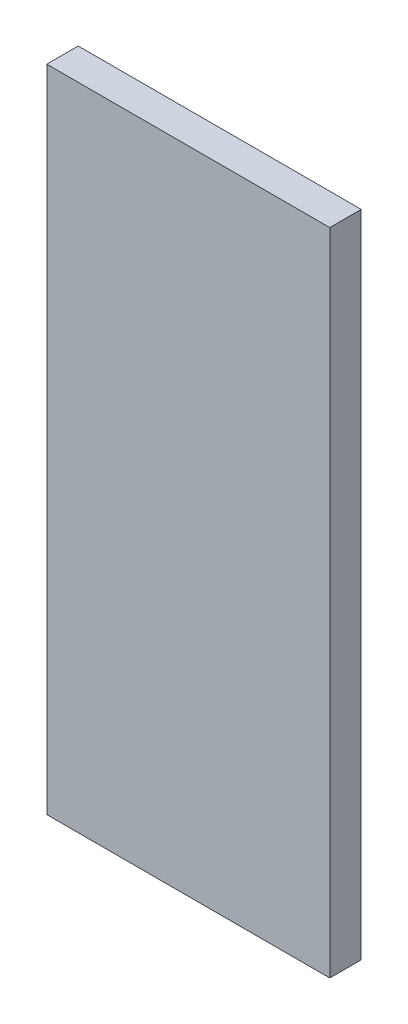
ISO-10303-21;
HEADER;
FILE_DESCRIPTION(('STEP AP214'),'2;1');
FILE_NAME('part.step','',(''),(''),'','','');
FILE_SCHEMA(('AUTOMOTIVE_DESIGN { 1 0 10303 214 1 1 1 1 }'));
ENDSEC;
DATA;
#1=APPLICATION_CONTEXT('core data for automotive mechanical design processes');
#2=APPLICATION_PROTOCOL_DEFINITION('international standard','automotive_design',2000,#1);
#3=PRODUCT_CONTEXT('',#1,'mechanical');
#4=PRODUCT('Part','Part','',(#3));
#5=PRODUCT_RELATED_PRODUCT_CATEGORY('part','',(#4));
#6=PRODUCT_DEFINITION_FORMATION('','',#4);
#7=PRODUCT_DEFINITION_CONTEXT('part definition',#1,'design');
#8=PRODUCT_DEFINITION('design','',#6,#7);
#9=PRODUCT_DEFINITION_SHAPE('','',#8);
#10=(LENGTH_UNIT() NAMED_UNIT(*) SI_UNIT(.MILLI.,.METRE.));
#11=(NAMED_UNIT(*) PLANE_ANGLE_UNIT() SI_UNIT($,.RADIAN.));
#12=(NAMED_UNIT(*) SI_UNIT($,.STERADIAN.) SOLID_ANGLE_UNIT());
#13=UNCERTAINTY_MEASURE_WITH_UNIT(LENGTH_MEASURE(1.E-05),#10,'distance_accuracy_value','');
#14=(GEOMETRIC_REPRESENTATION_CONTEXT(3) GLOBAL_UNCERTAINTY_ASSIGNED_CONTEXT((#13)) GLOBAL_UNIT_ASSIGNED_CONTEXT((#10,
#11,#12)) REPRESENTATION_CONTEXT('',''));
#15=CARTESIAN_POINT('',(0.,0.,0.));
#16=DIRECTION('',(0.,0.,1.));
#17=DIRECTION('',(1.,0.,0.));
#18=AXIS2_PLACEMENT_3D('',#15,#16,#17);
#19=CARTESIAN_POINT('',(13.5,31.,3.));
#20=DIRECTION('',(-1.,0.,0.));
#21=DIRECTION('',(0.,-1.,0.));
#22=AXIS2_PLACEMENT_3D('',#19,#20,#21);
#23=PLANE('',#22);
#24=DIRECTION('',(0.,1.,0.));
#25=VECTOR('',#24,1.);
#26=CARTESIAN_POINT('',(13.5,31.,0.));
#27=LINE('',#26,#25);
#28=CARTESIAN_POINT('',(13.5,-31.,0.));
#29=VERTEX_POINT('',#28);
#30=CARTESIAN_POINT('',(13.5,31.,0.));
#31=VERTEX_POINT('',#30);
#32=EDGE_CURVE('E96',#29,#31,#27,.T.);
#33=ORIENTED_EDGE('',*,*,#32,.T.);
#34=DIRECTION('',(0.,0.,-1.));
#35=VECTOR('',#34,1.);
#36=CARTESIAN_POINT('',(13.5,31.,3.));
#37=LINE('',#36,#35);
#38=CARTESIAN_POINT('',(13.5,31.,3.));
#39=VERTEX_POINT('',#38);
#40=EDGE_CURVE('E11',#39,#31,#37,.T.);
#41=ORIENTED_EDGE('',*,*,#40,.F.);
#42=DIRECTION('',(0.,1.,0.));
#43=VECTOR('',#42,1.);
#44=CARTESIAN_POINT('',(13.5,31.,3.));
#45=LINE('',#44,#43);
#46=CARTESIAN_POINT('',(13.5,-31.,3.));
#47=VERTEX_POINT('',#46);
#48=EDGE_CURVE('E84',#47,#39,#45,.T.);
#49=ORIENTED_EDGE('',*,*,#48,.F.);
#50=DIRECTION('',(0.,0.,-1.));
#51=VECTOR('',#50,1.);
#52=CARTESIAN_POINT('',(13.5,-31.,3.));
#53=LINE('',#52,#51);
#54=EDGE_CURVE('E92',#47,#29,#53,.T.);
#55=ORIENTED_EDGE('',*,*,#54,.T.);
#56=EDGE_LOOP('',(#33,#41,#49,#55));
#57=FACE_BOUND('',#56,.T.);
#58=ADVANCED_FACE('F33',(#57),#23,.F.);
#59=CARTESIAN_POINT('',(-13.5,31.,3.));
#60=DIRECTION('',(0.,-1.,0.));
#61=DIRECTION('',(0.,0.,-1.));
#62=AXIS2_PLACEMENT_3D('',#59,#60,#61);
#63=PLANE('',#62);
#64=DIRECTION('',(-1.,0.,0.));
#65=VECTOR('',#64,1.);
#66=CARTESIAN_POINT('',(-13.5,31.,0.));
#67=LINE('',#66,#65);
#68=CARTESIAN_POINT('',(-13.5,31.,0.));
#69=VERTEX_POINT('',#68);
#70=EDGE_CURVE('E88',#31,#69,#67,.T.);
#71=ORIENTED_EDGE('',*,*,#70,.T.);
#72=DIRECTION('',(0.,0.,-1.));
#73=VECTOR('',#72,1.);
#74=CARTESIAN_POINT('',(-13.5,31.,3.));
#75=LINE('',#74,#73);
#76=CARTESIAN_POINT('',(-13.5,31.,3.));
#77=VERTEX_POINT('',#76);
#78=EDGE_CURVE('E41',#77,#69,#75,.T.);
#79=ORIENTED_EDGE('',*,*,#78,.F.);
#80=DIRECTION('',(-1.,0.,0.));
#81=VECTOR('',#80,1.);
#82=CARTESIAN_POINT('',(-13.5,31.,3.));
#83=LINE('',#82,#81);
#84=EDGE_CURVE('E79',#39,#77,#83,.T.);
#85=ORIENTED_EDGE('',*,*,#84,.F.);
#86=ORIENTED_EDGE('',*,*,#40,.T.);
#87=EDGE_LOOP('',(#71,#79,#85,#86));
#88=FACE_BOUND('',#87,.T.);
#89=ADVANCED_FACE('F87',(#88),#63,.F.);
#90=CARTESIAN_POINT('',(-13.5,31.,3.));
#91=DIRECTION('',(1.,0.,0.));
#92=DIRECTION('',(0.,1.,0.));
#93=AXIS2_PLACEMENT_3D('',#90,#91,#92);
#94=PLANE('',#93);
#95=DIRECTION('',(0.,-1.,0.));
#96=VECTOR('',#95,1.);
#97=CARTESIAN_POINT('',(-13.5,31.,0.));
#98=LINE('',#97,#96);
#99=CARTESIAN_POINT('',(-13.5,-31.,0.));
#100=VERTEX_POINT('',#99);
#101=EDGE_CURVE('E66',#69,#100,#98,.T.);
#102=ORIENTED_EDGE('',*,*,#101,.T.);
#103=DIRECTION('',(0.,0.,-1.));
#104=VECTOR('',#103,1.);
#105=CARTESIAN_POINT('',(-13.5,-31.,3.));
#106=LINE('',#105,#104);
#107=CARTESIAN_POINT('',(-13.5,-31.,3.));
#108=VERTEX_POINT('',#107);
#109=EDGE_CURVE('E89',#108,#100,#106,.T.);
#110=ORIENTED_EDGE('',*,*,#109,.F.);
#111=DIRECTION('',(0.,-1.,0.));
#112=VECTOR('',#111,1.);
#113=CARTESIAN_POINT('',(-13.5,31.,3.));
#114=LINE('',#113,#112);
#115=EDGE_CURVE('E82',#77,#108,#114,.T.);
#116=ORIENTED_EDGE('',*,*,#115,.F.);
#117=ORIENTED_EDGE('',*,*,#78,.T.);
#118=EDGE_LOOP('',(#102,#110,#116,#117));
#119=FACE_BOUND('',#118,.T.);
#120=ADVANCED_FACE('F90',(#119),#94,.F.);
#121=CARTESIAN_POINT('',(-13.5,-31.,3.));
#122=DIRECTION('',(0.,1.,0.));
#123=DIRECTION('',(0.,0.,1.));
#124=AXIS2_PLACEMENT_3D('',#121,#122,#123);
#125=PLANE('',#124);
#126=DIRECTION('',(1.,0.,0.));
#127=VECTOR('',#126,1.);
#128=CARTESIAN_POINT('',(-13.5,-31.,0.));
#129=LINE('',#128,#127);
#130=EDGE_CURVE('E72',#100,#29,#129,.T.);
#131=ORIENTED_EDGE('',*,*,#130,.T.);
#132=ORIENTED_EDGE('',*,*,#54,.F.);
#133=DIRECTION('',(1.,0.,0.));
#134=VECTOR('',#133,1.);
#135=CARTESIAN_POINT('',(-13.5,-31.,3.));
#136=LINE('',#135,#134);
#137=EDGE_CURVE('E49',#108,#47,#136,.T.);
#138=ORIENTED_EDGE('',*,*,#137,.F.);
#139=ORIENTED_EDGE('',*,*,#109,.T.);
#140=EDGE_LOOP('',(#131,#132,#138,#139));
#141=FACE_BOUND('',#140,.T.);
#142=ADVANCED_FACE('F103',(#141),#125,.F.);
#143=CARTESIAN_POINT('',(0.,0.,3.));
#144=DIRECTION('',(0.,0.,1.));
#145=DIRECTION('',(1.,0.,0.));
#146=AXIS2_PLACEMENT_3D('',#143,#144,#145);
#147=PLANE('',#146);
#148=ORIENTED_EDGE('',*,*,#48,.T.);
#149=ORIENTED_EDGE('',*,*,#84,.T.);
#150=ORIENTED_EDGE('',*,*,#115,.T.);
#151=ORIENTED_EDGE('',*,*,#137,.T.);
#152=EDGE_LOOP('',(#148,#149,#150,#151));
#153=FACE_BOUND('',#152,.T.);
#154=ADVANCED_FACE('F80',(#153),#147,.T.);
#155=CARTESIAN_POINT('',(0.,0.,0.));
#156=DIRECTION('',(0.,0.,1.));
#157=DIRECTION('',(1.,0.,0.));
#158=AXIS2_PLACEMENT_3D('',#155,#156,#157);
#159=PLANE('',#158);
#160=ORIENTED_EDGE('',*,*,#32,.F.);
#161=ORIENTED_EDGE('',*,*,#130,.F.);
#162=ORIENTED_EDGE('',*,*,#101,.F.);
#163=ORIENTED_EDGE('',*,*,#70,.F.);
#164=EDGE_LOOP('',(#160,#161,#162,#163));
#165=FACE_BOUND('',#164,.T.);
#166=ADVANCED_FACE('F106',(#165),#159,.F.);
#167=CLOSED_SHELL('',(#58,#89,#120,#142,#154,#166));
#168=MANIFOLD_SOLID_BREP('B2',#167);
#169=ADVANCED_BREP_SHAPE_REPRESENTATION('',(#18,#168),#14);
#170=SHAPE_DEFINITION_REPRESENTATION(#9,#169);
ENDSEC;
END-ISO-10303-21;
